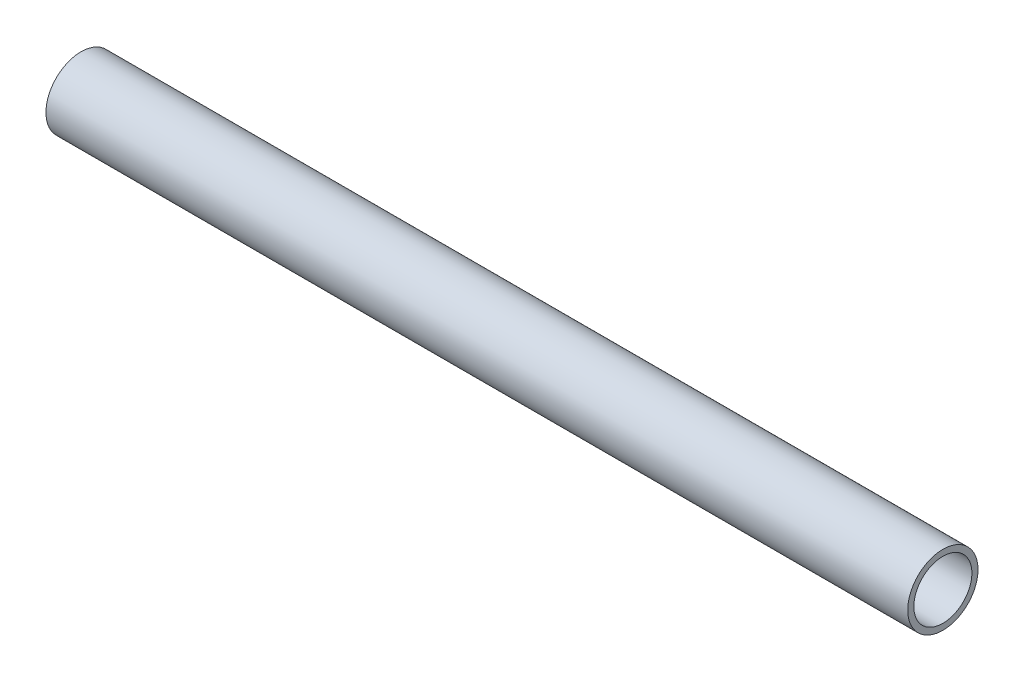
ISO-10303-21;
HEADER;
FILE_DESCRIPTION(('STEP AP214'),'2;1');
FILE_NAME('part.step','',(''),(''),'','','');
FILE_SCHEMA(('AUTOMOTIVE_DESIGN { 1 0 10303 214 1 1 1 1 }'));
ENDSEC;
DATA;
#1=APPLICATION_CONTEXT('core data for automotive mechanical design processes');
#2=APPLICATION_PROTOCOL_DEFINITION('international standard','automotive_design',2000,#1);
#3=PRODUCT_CONTEXT('',#1,'mechanical');
#4=PRODUCT('Part','Part','',(#3));
#5=PRODUCT_RELATED_PRODUCT_CATEGORY('part','',(#4));
#6=PRODUCT_DEFINITION_FORMATION('','',#4);
#7=PRODUCT_DEFINITION_CONTEXT('part definition',#1,'design');
#8=PRODUCT_DEFINITION('design','',#6,#7);
#9=PRODUCT_DEFINITION_SHAPE('','',#8);
#10=(LENGTH_UNIT() NAMED_UNIT(*) SI_UNIT(.MILLI.,.METRE.));
#11=(NAMED_UNIT(*) PLANE_ANGLE_UNIT() SI_UNIT($,.RADIAN.));
#12=(NAMED_UNIT(*) SI_UNIT($,.STERADIAN.) SOLID_ANGLE_UNIT());
#13=UNCERTAINTY_MEASURE_WITH_UNIT(LENGTH_MEASURE(1.E-05),#10,'distance_accuracy_value','');
#14=(GEOMETRIC_REPRESENTATION_CONTEXT(3) GLOBAL_UNCERTAINTY_ASSIGNED_CONTEXT((#13)) GLOBAL_UNIT_ASSIGNED_CONTEXT((#10,
#11,#12)) REPRESENTATION_CONTEXT('',''));
#15=CARTESIAN_POINT('',(0.,0.,0.));
#16=DIRECTION('',(0.,0.,1.));
#17=DIRECTION('',(1.,0.,0.));
#18=AXIS2_PLACEMENT_3D('',#15,#16,#17);
#19=CARTESIAN_POINT('',(116.84,0.,0.));
#20=DIRECTION('',(1.,0.,0.));
#21=DIRECTION('',(0.,0.,-1.));
#22=AXIS2_PLACEMENT_3D('',#19,#20,#21);
#23=PLANE('',#22);
#24=CARTESIAN_POINT('',(116.84,0.,0.));
#25=DIRECTION('',(1.,0.,0.));
#26=DIRECTION('',(0.,0.,-1.));
#27=AXIS2_PLACEMENT_3D('',#24,#25,#26);
#28=CIRCLE('',#27,9.525);
#29=CARTESIAN_POINT('',(116.84,0.,-9.525));
#30=VERTEX_POINT('',#29);
#31=EDGE_CURVE('E10',#30,#30,#28,.T.);
#32=ORIENTED_EDGE('',*,*,#31,.T.);
#33=EDGE_LOOP('',(#32));
#34=FACE_BOUND('',#33,.T.);
#35=CARTESIAN_POINT('',(116.84,0.,0.));
#36=DIRECTION('',(1.,0.,0.));
#37=DIRECTION('',(0.,0.,-1.));
#38=AXIS2_PLACEMENT_3D('',#35,#36,#37);
#39=CIRCLE('',#38,7.874);
#40=CARTESIAN_POINT('',(116.84,0.,-7.874));
#41=VERTEX_POINT('',#40);
#42=EDGE_CURVE('E43',#41,#41,#39,.T.);
#43=ORIENTED_EDGE('',*,*,#42,.F.);
#44=EDGE_LOOP('',(#43));
#45=FACE_BOUND('',#44,.T.);
#46=ADVANCED_FACE('F32',(#34,#45),#23,.T.);
#47=CARTESIAN_POINT('',(-116.84,0.,0.));
#48=DIRECTION('',(1.,0.,0.));
#49=DIRECTION('',(0.,0.,-1.));
#50=AXIS2_PLACEMENT_3D('',#47,#48,#49);
#51=PLANE('',#50);
#52=CARTESIAN_POINT('',(-116.84,0.,0.));
#53=DIRECTION('',(1.,0.,0.));
#54=DIRECTION('',(0.,0.,-1.));
#55=AXIS2_PLACEMENT_3D('',#52,#53,#54);
#56=CIRCLE('',#55,9.525);
#57=CARTESIAN_POINT('',(-116.84,0.,-9.525));
#58=VERTEX_POINT('',#57);
#59=EDGE_CURVE('E36',#58,#58,#56,.T.);
#60=ORIENTED_EDGE('',*,*,#59,.F.);
#61=EDGE_LOOP('',(#60));
#62=FACE_BOUND('',#61,.T.);
#63=CARTESIAN_POINT('',(-116.84,0.,0.));
#64=DIRECTION('',(1.,0.,0.));
#65=DIRECTION('',(0.,0.,-1.));
#66=AXIS2_PLACEMENT_3D('',#63,#64,#65);
#67=CIRCLE('',#66,7.874);
#68=CARTESIAN_POINT('',(-116.84,0.,-7.874));
#69=VERTEX_POINT('',#68);
#70=EDGE_CURVE('E45',#69,#69,#67,.T.);
#71=ORIENTED_EDGE('',*,*,#70,.T.);
#72=EDGE_LOOP('',(#71));
#73=FACE_BOUND('',#72,.T.);
#74=ADVANCED_FACE('F55',(#62,#73),#51,.F.);
#75=CARTESIAN_POINT('',(116.84,0.,0.));
#76=DIRECTION('',(-1.,0.,0.));
#77=DIRECTION('',(0.,0.,1.));
#78=AXIS2_PLACEMENT_3D('',#75,#76,#77);
#79=CYLINDRICAL_SURFACE('',#78,9.525);
#80=ORIENTED_EDGE('',*,*,#31,.F.);
#81=EDGE_LOOP('',(#80));
#82=FACE_BOUND('',#81,.T.);
#83=ORIENTED_EDGE('',*,*,#59,.T.);
#84=EDGE_LOOP('',(#83));
#85=FACE_BOUND('',#84,.T.);
#86=ADVANCED_FACE('F34',(#82,#85),#79,.T.);
#87=CARTESIAN_POINT('',(116.84,0.,0.));
#88=DIRECTION('',(-1.,0.,0.));
#89=DIRECTION('',(0.,0.,1.));
#90=AXIS2_PLACEMENT_3D('',#87,#88,#89);
#91=CYLINDRICAL_SURFACE('',#90,7.874);
#92=ORIENTED_EDGE('',*,*,#42,.T.);
#93=EDGE_LOOP('',(#92));
#94=FACE_BOUND('',#93,.T.);
#95=ORIENTED_EDGE('',*,*,#70,.F.);
#96=EDGE_LOOP('',(#95));
#97=FACE_BOUND('',#96,.T.);
#98=ADVANCED_FACE('F51',(#94,#97),#91,.F.);
#99=CLOSED_SHELL('',(#46,#74,#86,#98));
#100=MANIFOLD_SOLID_BREP('B2',#99);
#101=ADVANCED_BREP_SHAPE_REPRESENTATION('',(#18,#100),#14);
#102=SHAPE_DEFINITION_REPRESENTATION(#9,#101);
ENDSEC;
END-ISO-10303-21;
